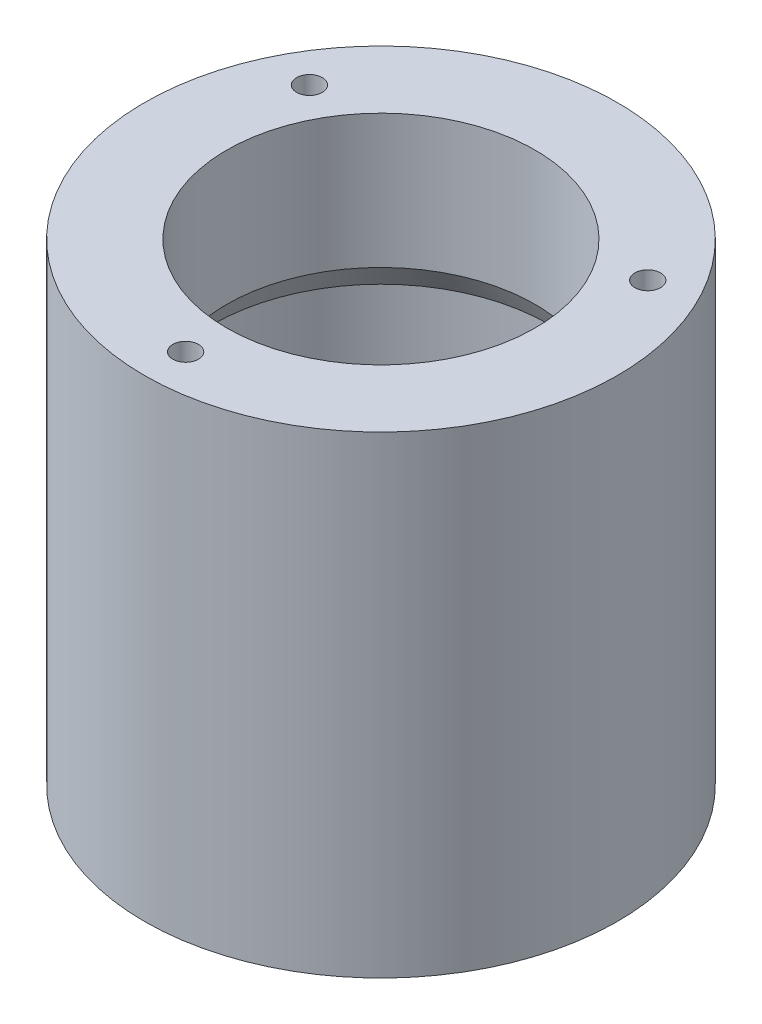
ISO-10303-21;
HEADER;
FILE_DESCRIPTION(('STEP AP214'),'2;1');
FILE_NAME('part.step','',(''),(''),'','','');
FILE_SCHEMA(('AUTOMOTIVE_DESIGN { 1 0 10303 214 1 1 1 1 }'));
ENDSEC;
DATA;
#1=APPLICATION_CONTEXT('core data for automotive mechanical design processes');
#2=APPLICATION_PROTOCOL_DEFINITION('international standard','automotive_design',2000,#1);
#3=PRODUCT_CONTEXT('',#1,'mechanical');
#4=PRODUCT('Part','Part','',(#3));
#5=PRODUCT_RELATED_PRODUCT_CATEGORY('part','',(#4));
#6=PRODUCT_DEFINITION_FORMATION('','',#4);
#7=PRODUCT_DEFINITION_CONTEXT('part definition',#1,'design');
#8=PRODUCT_DEFINITION('design','',#6,#7);
#9=PRODUCT_DEFINITION_SHAPE('','',#8);
#10=(LENGTH_UNIT() NAMED_UNIT(*) SI_UNIT(.MILLI.,.METRE.));
#11=(NAMED_UNIT(*) PLANE_ANGLE_UNIT() SI_UNIT($,.RADIAN.));
#12=(NAMED_UNIT(*) SI_UNIT($,.STERADIAN.) SOLID_ANGLE_UNIT());
#13=UNCERTAINTY_MEASURE_WITH_UNIT(LENGTH_MEASURE(1.E-05),#10,'distance_accuracy_value','');
#14=(GEOMETRIC_REPRESENTATION_CONTEXT(3) GLOBAL_UNCERTAINTY_ASSIGNED_CONTEXT((#13)) GLOBAL_UNIT_ASSIGNED_CONTEXT((#10,
#11,#12)) REPRESENTATION_CONTEXT('',''));
#15=CARTESIAN_POINT('',(0.,0.,0.));
#16=DIRECTION('',(0.,0.,1.));
#17=DIRECTION('',(1.,0.,0.));
#18=AXIS2_PLACEMENT_3D('',#15,#16,#17);
#19=CARTESIAN_POINT('',(0.,0.,0.));
#20=DIRECTION('',(0.,1.,0.));
#21=DIRECTION('',(0.,0.,1.));
#22=AXIS2_PLACEMENT_3D('',#19,#20,#21);
#23=PLANE('',#22);
#24=CARTESIAN_POINT('',(-16.4544826719044,0.,-9.49999999999985));
#25=DIRECTION('',(0.,-1.,0.));
#26=DIRECTION('',(0.,0.,-1.));
#27=AXIS2_PLACEMENT_3D('',#24,#25,#26);
#28=CIRCLE('',#27,2.1);
#29=CARTESIAN_POINT('',(-16.4544826719044,0.,-11.5999999999998));
#30=VERTEX_POINT('',#29);
#31=EDGE_CURVE('E91',#30,#30,#28,.T.);
#32=ORIENTED_EDGE('',*,*,#31,.F.);
#33=EDGE_LOOP('',(#32));
#34=FACE_BOUND('',#33,.T.);
#35=CARTESIAN_POINT('',(16.4544826719043,0.,-9.50000000000008));
#36=DIRECTION('',(0.,-1.,0.));
#37=DIRECTION('',(0.,0.,-1.));
#38=AXIS2_PLACEMENT_3D('',#35,#36,#37);
#39=CIRCLE('',#38,2.1);
#40=CARTESIAN_POINT('',(16.4544826719043,0.,-11.6000000000001));
#41=VERTEX_POINT('',#40);
#42=EDGE_CURVE('E97',#41,#41,#39,.T.);
#43=ORIENTED_EDGE('',*,*,#42,.F.);
#44=EDGE_LOOP('',(#43));
#45=FACE_BOUND('',#44,.T.);
#46=CARTESIAN_POINT('',(0.,0.,19.));
#47=DIRECTION('',(0.,-1.,0.));
#48=DIRECTION('',(0.,0.,-1.));
#49=AXIS2_PLACEMENT_3D('',#46,#47,#48);
#50=CIRCLE('',#49,2.1);
#51=CARTESIAN_POINT('',(0.,0.,16.9));
#52=VERTEX_POINT('',#51);
#53=EDGE_CURVE('E103',#52,#52,#50,.T.);
#54=ORIENTED_EDGE('',*,*,#53,.F.);
#55=EDGE_LOOP('',(#54));
#56=FACE_BOUND('',#55,.T.);
#57=CARTESIAN_POINT('',(0.,0.,0.));
#58=DIRECTION('',(0.,-1.,0.));
#59=DIRECTION('',(0.,0.,-1.));
#60=AXIS2_PLACEMENT_3D('',#57,#58,#59);
#61=CIRCLE('',#60,12.5);
#62=CARTESIAN_POINT('',(0.,0.,-12.5));
#63=VERTEX_POINT('',#62);
#64=EDGE_CURVE('E109',#63,#63,#61,.T.);
#65=ORIENTED_EDGE('',*,*,#64,.F.);
#66=EDGE_LOOP('',(#65));
#67=FACE_BOUND('',#66,.T.);
#68=CARTESIAN_POINT('',(0.,0.,0.));
#69=DIRECTION('',(0.,1.,0.));
#70=DIRECTION('',(0.,0.,1.));
#71=AXIS2_PLACEMENT_3D('',#68,#69,#70);
#72=CIRCLE('',#71,23.);
#73=CARTESIAN_POINT('',(0.,0.,23.));
#74=VERTEX_POINT('',#73);
#75=EDGE_CURVE('E11',#74,#74,#72,.T.);
#76=ORIENTED_EDGE('',*,*,#75,.F.);
#77=EDGE_LOOP('',(#76));
#78=FACE_BOUND('',#77,.T.);
#79=ADVANCED_FACE('F37',(#34,#45,#56,#67,#78),#23,.F.);
#80=CARTESIAN_POINT('',(0.,6.,0.));
#81=DIRECTION('',(0.,1.,0.));
#82=DIRECTION('',(0.,0.,1.));
#83=AXIS2_PLACEMENT_3D('',#80,#81,#82);
#84=CYLINDRICAL_SURFACE('',#83,23.);
#85=CARTESIAN_POINT('',(0.,46.,0.));
#86=DIRECTION('',(0.,1.,0.));
#87=DIRECTION('',(0.,0.,1.));
#88=AXIS2_PLACEMENT_3D('',#85,#86,#87);
#89=CIRCLE('',#88,23.);
#90=CARTESIAN_POINT('',(0.,46.,23.));
#91=VERTEX_POINT('',#90);
#92=EDGE_CURVE('E45',#91,#91,#89,.T.);
#93=ORIENTED_EDGE('',*,*,#92,.F.);
#94=EDGE_LOOP('',(#93));
#95=FACE_BOUND('',#94,.T.);
#96=ORIENTED_EDGE('',*,*,#75,.T.);
#97=EDGE_LOOP('',(#96));
#98=FACE_BOUND('',#97,.T.);
#99=ADVANCED_FACE('F135',(#95,#98),#84,.T.);
#100=CARTESIAN_POINT('',(23.,46.,0.));
#101=DIRECTION('',(0.,-1.,0.));
#102=DIRECTION('',(0.,0.,-1.));
#103=AXIS2_PLACEMENT_3D('',#100,#101,#102);
#104=PLANE('',#103);
#105=CARTESIAN_POINT('',(-16.4544826719044,46.,-9.49999999999985));
#106=DIRECTION('',(0.,1.,0.));
#107=DIRECTION('',(0.,0.,1.));
#108=AXIS2_PLACEMENT_3D('',#105,#106,#107);
#109=CIRCLE('',#108,1.24999999999999);
#110=CARTESIAN_POINT('',(-16.4544826719044,46.,-8.24999999999986));
#111=VERTEX_POINT('',#110);
#112=EDGE_CURVE('E75',#111,#111,#109,.T.);
#113=ORIENTED_EDGE('',*,*,#112,.F.);
#114=EDGE_LOOP('',(#113));
#115=FACE_BOUND('',#114,.T.);
#116=CARTESIAN_POINT('',(16.4544826719043,46.,-9.50000000000008));
#117=DIRECTION('',(0.,1.,0.));
#118=DIRECTION('',(0.,0.,1.));
#119=AXIS2_PLACEMENT_3D('',#116,#117,#118);
#120=CIRCLE('',#119,1.24999999999999);
#121=CARTESIAN_POINT('',(16.4544826719043,46.,-8.25000000000009));
#122=VERTEX_POINT('',#121);
#123=EDGE_CURVE('E74',#122,#122,#120,.T.);
#124=ORIENTED_EDGE('',*,*,#123,.F.);
#125=EDGE_LOOP('',(#124));
#126=FACE_BOUND('',#125,.T.);
#127=CARTESIAN_POINT('',(0.,46.,19.));
#128=DIRECTION('',(0.,1.,0.));
#129=DIRECTION('',(0.,0.,1.));
#130=AXIS2_PLACEMENT_3D('',#127,#128,#129);
#131=CIRCLE('',#130,1.24999999999999);
#132=CARTESIAN_POINT('',(0.,46.,20.25));
#133=VERTEX_POINT('',#132);
#134=EDGE_CURVE('E85',#133,#133,#131,.T.);
#135=ORIENTED_EDGE('',*,*,#134,.F.);
#136=EDGE_LOOP('',(#135));
#137=FACE_BOUND('',#136,.T.);
#138=CARTESIAN_POINT('',(0.,46.,0.));
#139=DIRECTION('',(0.,1.,0.));
#140=DIRECTION('',(0.,0.,1.));
#141=AXIS2_PLACEMENT_3D('',#138,#139,#140);
#142=CIRCLE('',#141,15.);
#143=CARTESIAN_POINT('',(0.,46.,15.));
#144=VERTEX_POINT('',#143);
#145=EDGE_CURVE('E127',#144,#144,#142,.T.);
#146=ORIENTED_EDGE('',*,*,#145,.F.);
#147=EDGE_LOOP('',(#146));
#148=FACE_BOUND('',#147,.T.);
#149=ORIENTED_EDGE('',*,*,#92,.T.);
#150=EDGE_LOOP('',(#149));
#151=FACE_BOUND('',#150,.T.);
#152=ADVANCED_FACE('F133',(#115,#126,#137,#148,#151),#104,.F.);
#153=CARTESIAN_POINT('',(0.,6.,0.));
#154=DIRECTION('',(0.,1.,0.));
#155=DIRECTION('',(0.,0.,1.));
#156=AXIS2_PLACEMENT_3D('',#153,#154,#155);
#157=CYLINDRICAL_SURFACE('',#156,15.);
#158=CARTESIAN_POINT('',(0.,33.,0.));
#159=DIRECTION('',(0.,1.,0.));
#160=DIRECTION('',(0.,0.,1.));
#161=AXIS2_PLACEMENT_3D('',#158,#159,#160);
#162=CIRCLE('',#161,15.);
#163=CARTESIAN_POINT('',(0.,33.,15.));
#164=VERTEX_POINT('',#163);
#165=EDGE_CURVE('E124',#164,#164,#162,.T.);
#166=ORIENTED_EDGE('',*,*,#165,.F.);
#167=EDGE_LOOP('',(#166));
#168=FACE_BOUND('',#167,.T.);
#169=ORIENTED_EDGE('',*,*,#145,.T.);
#170=EDGE_LOOP('',(#169));
#171=FACE_BOUND('',#170,.T.);
#172=ADVANCED_FACE('F187',(#168,#171),#157,.F.);
#173=CARTESIAN_POINT('',(0.,33.,0.));
#174=DIRECTION('',(0.,-1.,0.));
#175=DIRECTION('',(0.,0.,-1.));
#176=AXIS2_PLACEMENT_3D('',#173,#174,#175);
#177=CONICAL_SURFACE('',#176,15.,0.523598775598296);
#178=CARTESIAN_POINT('',(0.,30.614824582188,0.));
#179=DIRECTION('',(0.,1.,0.));
#180=DIRECTION('',(0.,0.,1.));
#181=AXIS2_PLACEMENT_3D('',#178,#179,#180);
#182=CIRCLE('',#181,16.3770816695382);
#183=CARTESIAN_POINT('',(0.,30.614824582188,16.3770816695382));
#184=VERTEX_POINT('',#183);
#185=EDGE_CURVE('E121',#184,#184,#182,.T.);
#186=ORIENTED_EDGE('',*,*,#185,.F.);
#187=EDGE_LOOP('',(#186));
#188=FACE_BOUND('',#187,.T.);
#189=ORIENTED_EDGE('',*,*,#165,.T.);
#190=EDGE_LOOP('',(#189));
#191=FACE_BOUND('',#190,.T.);
#192=ADVANCED_FACE('F181',(#188,#191),#177,.F.);
#193=CARTESIAN_POINT('',(0.,6.,0.));
#194=DIRECTION('',(0.,1.,0.));
#195=DIRECTION('',(0.,0.,1.));
#196=AXIS2_PLACEMENT_3D('',#193,#194,#195);
#197=CYLINDRICAL_SURFACE('',#196,16.3770816695382);
#198=CARTESIAN_POINT('',(0.,18.385175417812,0.));
#199=DIRECTION('',(0.,1.,0.));
#200=DIRECTION('',(0.,0.,1.));
#201=AXIS2_PLACEMENT_3D('',#198,#199,#200);
#202=CIRCLE('',#201,16.3770816695382);
#203=CARTESIAN_POINT('',(0.,18.385175417812,16.3770816695382));
#204=VERTEX_POINT('',#203);
#205=EDGE_CURVE('E118',#204,#204,#202,.T.);
#206=ORIENTED_EDGE('',*,*,#205,.F.);
#207=EDGE_LOOP('',(#206));
#208=FACE_BOUND('',#207,.T.);
#209=ORIENTED_EDGE('',*,*,#185,.T.);
#210=EDGE_LOOP('',(#209));
#211=FACE_BOUND('',#210,.T.);
#212=ADVANCED_FACE('F175',(#208,#211),#197,.F.);
#213=CARTESIAN_POINT('',(0.,18.385175417812,0.));
#214=DIRECTION('',(0.,1.,0.));
#215=DIRECTION('',(0.,0.,1.));
#216=AXIS2_PLACEMENT_3D('',#213,#214,#215);
#217=CONICAL_SURFACE('',#216,16.3770816695382,0.523598775598296);
#218=CARTESIAN_POINT('',(0.,16.,0.));
#219=DIRECTION('',(0.,1.,0.));
#220=DIRECTION('',(0.,0.,1.));
#221=AXIS2_PLACEMENT_3D('',#218,#219,#220);
#222=CIRCLE('',#221,15.);
#223=CARTESIAN_POINT('',(0.,16.,15.));
#224=VERTEX_POINT('',#223);
#225=EDGE_CURVE('E115',#224,#224,#222,.T.);
#226=ORIENTED_EDGE('',*,*,#225,.F.);
#227=EDGE_LOOP('',(#226));
#228=FACE_BOUND('',#227,.T.);
#229=ORIENTED_EDGE('',*,*,#205,.T.);
#230=EDGE_LOOP('',(#229));
#231=FACE_BOUND('',#230,.T.);
#232=ADVANCED_FACE('F169',(#228,#231),#217,.F.);
#233=CARTESIAN_POINT('',(0.,6.,0.));
#234=DIRECTION('',(0.,1.,0.));
#235=DIRECTION('',(0.,0.,1.));
#236=AXIS2_PLACEMENT_3D('',#233,#234,#235);
#237=CYLINDRICAL_SURFACE('',#236,15.);
#238=CARTESIAN_POINT('',(0.,6.,0.));
#239=DIRECTION('',(0.,1.,0.));
#240=DIRECTION('',(0.,0.,1.));
#241=AXIS2_PLACEMENT_3D('',#238,#239,#240);
#242=CIRCLE('',#241,15.);
#243=CARTESIAN_POINT('',(0.,6.,15.));
#244=VERTEX_POINT('',#243);
#245=EDGE_CURVE('E112',#244,#244,#242,.T.);
#246=ORIENTED_EDGE('',*,*,#245,.F.);
#247=EDGE_LOOP('',(#246));
#248=FACE_BOUND('',#247,.T.);
#249=ORIENTED_EDGE('',*,*,#225,.T.);
#250=EDGE_LOOP('',(#249));
#251=FACE_BOUND('',#250,.T.);
#252=ADVANCED_FACE('F163',(#248,#251),#237,.F.);
#253=CARTESIAN_POINT('',(15.,6.,0.));
#254=DIRECTION('',(0.,-1.,0.));
#255=DIRECTION('',(0.,0.,-1.));
#256=AXIS2_PLACEMENT_3D('',#253,#254,#255);
#257=PLANE('',#256);
#258=CARTESIAN_POINT('',(0.,6.,0.));
#259=DIRECTION('',(0.,-1.,0.));
#260=DIRECTION('',(0.,0.,-1.));
#261=AXIS2_PLACEMENT_3D('',#258,#259,#260);
#262=CIRCLE('',#261,12.5);
#263=CARTESIAN_POINT('',(0.,6.,-12.5));
#264=VERTEX_POINT('',#263);
#265=EDGE_CURVE('E40',#264,#264,#262,.T.);
#266=ORIENTED_EDGE('',*,*,#265,.T.);
#267=EDGE_LOOP('',(#266));
#268=FACE_BOUND('',#267,.T.);
#269=ORIENTED_EDGE('',*,*,#245,.T.);
#270=EDGE_LOOP('',(#269));
#271=FACE_BOUND('',#270,.T.);
#272=ADVANCED_FACE('F156',(#268,#271),#257,.F.);
#273=CARTESIAN_POINT('',(0.,46.,0.));
#274=DIRECTION('',(0.,-1.,0.));
#275=DIRECTION('',(0.,0.,-1.));
#276=AXIS2_PLACEMENT_3D('',#273,#274,#275);
#277=CYLINDRICAL_SURFACE('',#276,12.5);
#278=ORIENTED_EDGE('',*,*,#64,.T.);
#279=EDGE_LOOP('',(#278));
#280=FACE_BOUND('',#279,.T.);
#281=ORIENTED_EDGE('',*,*,#265,.F.);
#282=EDGE_LOOP('',(#281));
#283=FACE_BOUND('',#282,.T.);
#284=ADVANCED_FACE('F152',(#280,#283),#277,.F.);
#285=CARTESIAN_POINT('',(0.,12.,19.));
#286=DIRECTION('',(0.,-1.,0.));
#287=DIRECTION('',(0.,0.,-1.));
#288=AXIS2_PLACEMENT_3D('',#285,#286,#287);
#289=CONICAL_SURFACE('',#288,2.1,1.02974425867665);
#290=CARTESIAN_POINT('',(0.,13.2618072999579,19.));
#291=VERTEX_POINT('',#290);
#292=VERTEX_LOOP('',#291);
#293=FACE_BOUND('',#292,.T.);
#294=CARTESIAN_POINT('',(0.,12.,19.));
#295=DIRECTION('',(0.,-1.,0.));
#296=DIRECTION('',(0.,0.,-1.));
#297=AXIS2_PLACEMENT_3D('',#294,#295,#296);
#298=CIRCLE('',#297,2.1);
#299=CARTESIAN_POINT('',(0.,12.,16.9));
#300=VERTEX_POINT('',#299);
#301=EDGE_CURVE('E106',#300,#300,#298,.T.);
#302=ORIENTED_EDGE('',*,*,#301,.T.);
#303=EDGE_LOOP('',(#302));
#304=FACE_BOUND('',#303,.T.);
#305=ADVANCED_FACE('F155',(#293,#304),#289,.F.);
#306=CARTESIAN_POINT('',(0.,0.,19.));
#307=DIRECTION('',(0.,-1.,0.));
#308=DIRECTION('',(0.,0.,-1.));
#309=AXIS2_PLACEMENT_3D('',#306,#307,#308);
#310=CYLINDRICAL_SURFACE('',#309,2.1);
#311=ORIENTED_EDGE('',*,*,#301,.F.);
#312=EDGE_LOOP('',(#311));
#313=FACE_BOUND('',#312,.T.);
#314=ORIENTED_EDGE('',*,*,#53,.T.);
#315=EDGE_LOOP('',(#314));
#316=FACE_BOUND('',#315,.T.);
#317=ADVANCED_FACE('F206',(#313,#316),#310,.F.);
#318=CARTESIAN_POINT('',(16.4544826719043,12.,-9.50000000000008));
#319=DIRECTION('',(0.,-1.,0.));
#320=DIRECTION('',(0.,0.,-1.));
#321=AXIS2_PLACEMENT_3D('',#318,#319,#320);
#322=CONICAL_SURFACE('',#321,2.1,1.02974425867665);
#323=CARTESIAN_POINT('',(16.4544826719043,13.2618072999579,-9.50000000000008));
#324=VERTEX_POINT('',#323);
#325=VERTEX_LOOP('',#324);
#326=FACE_BOUND('',#325,.T.);
#327=CARTESIAN_POINT('',(16.4544826719043,12.,-9.50000000000008));
#328=DIRECTION('',(0.,-1.,0.));
#329=DIRECTION('',(0.,0.,-1.));
#330=AXIS2_PLACEMENT_3D('',#327,#328,#329);
#331=CIRCLE('',#330,2.1);
#332=CARTESIAN_POINT('',(16.4544826719043,12.,-11.6000000000001));
#333=VERTEX_POINT('',#332);
#334=EDGE_CURVE('E100',#333,#333,#331,.T.);
#335=ORIENTED_EDGE('',*,*,#334,.T.);
#336=EDGE_LOOP('',(#335));
#337=FACE_BOUND('',#336,.T.);
#338=ADVANCED_FACE('F209',(#326,#337),#322,.F.);
#339=CARTESIAN_POINT('',(16.4544826719043,0.,-9.50000000000008));
#340=DIRECTION('',(0.,-1.,0.));
#341=DIRECTION('',(0.,0.,-1.));
#342=AXIS2_PLACEMENT_3D('',#339,#340,#341);
#343=CYLINDRICAL_SURFACE('',#342,2.1);
#344=ORIENTED_EDGE('',*,*,#334,.F.);
#345=EDGE_LOOP('',(#344));
#346=FACE_BOUND('',#345,.T.);
#347=ORIENTED_EDGE('',*,*,#42,.T.);
#348=EDGE_LOOP('',(#347));
#349=FACE_BOUND('',#348,.T.);
#350=ADVANCED_FACE('F213',(#346,#349),#343,.F.);
#351=CARTESIAN_POINT('',(-16.4544826719044,12.,-9.49999999999985));
#352=DIRECTION('',(0.,-1.,0.));
#353=DIRECTION('',(0.,0.,-1.));
#354=AXIS2_PLACEMENT_3D('',#351,#352,#353);
#355=CONICAL_SURFACE('',#354,2.1,1.02974425867665);
#356=CARTESIAN_POINT('',(-16.4544826719044,13.2618072999579,-9.49999999999985));
#357=VERTEX_POINT('',#356);
#358=VERTEX_LOOP('',#357);
#359=FACE_BOUND('',#358,.T.);
#360=CARTESIAN_POINT('',(-16.4544826719044,12.,-9.49999999999985));
#361=DIRECTION('',(0.,-1.,0.));
#362=DIRECTION('',(0.,0.,-1.));
#363=AXIS2_PLACEMENT_3D('',#360,#361,#362);
#364=CIRCLE('',#363,2.1);
#365=CARTESIAN_POINT('',(-16.4544826719044,12.,-11.5999999999998));
#366=VERTEX_POINT('',#365);
#367=EDGE_CURVE('E94',#366,#366,#364,.T.);
#368=ORIENTED_EDGE('',*,*,#367,.T.);
#369=EDGE_LOOP('',(#368));
#370=FACE_BOUND('',#369,.T.);
#371=ADVANCED_FACE('F216',(#359,#370),#355,.F.);
#372=CARTESIAN_POINT('',(-16.4544826719044,0.,-9.49999999999985));
#373=DIRECTION('',(0.,-1.,0.));
#374=DIRECTION('',(0.,0.,-1.));
#375=AXIS2_PLACEMENT_3D('',#372,#373,#374);
#376=CYLINDRICAL_SURFACE('',#375,2.1);
#377=ORIENTED_EDGE('',*,*,#367,.F.);
#378=EDGE_LOOP('',(#377));
#379=FACE_BOUND('',#378,.T.);
#380=ORIENTED_EDGE('',*,*,#31,.T.);
#381=EDGE_LOOP('',(#380));
#382=FACE_BOUND('',#381,.T.);
#383=ADVANCED_FACE('F220',(#379,#382),#376,.F.);
#384=CARTESIAN_POINT('',(0.,37.5,19.));
#385=DIRECTION('',(0.,1.,0.));
#386=DIRECTION('',(0.,0.,1.));
#387=AXIS2_PLACEMENT_3D('',#384,#385,#386);
#388=CONICAL_SURFACE('',#387,1.25,1.02974425867665);
#389=CARTESIAN_POINT('',(0.,36.7489242262155,19.));
#390=VERTEX_POINT('',#389);
#391=VERTEX_LOOP('',#390);
#392=FACE_BOUND('',#391,.T.);
#393=CARTESIAN_POINT('',(0.,37.5,19.));
#394=DIRECTION('',(0.,1.,0.));
#395=DIRECTION('',(0.,0.,1.));
#396=AXIS2_PLACEMENT_3D('',#393,#394,#395);
#397=CIRCLE('',#396,1.25);
#398=CARTESIAN_POINT('',(0.,37.5,20.25));
#399=VERTEX_POINT('',#398);
#400=EDGE_CURVE('E88',#399,#399,#397,.T.);
#401=ORIENTED_EDGE('',*,*,#400,.T.);
#402=EDGE_LOOP('',(#401));
#403=FACE_BOUND('',#402,.T.);
#404=ADVANCED_FACE('F224',(#392,#403),#388,.F.);
#405=CARTESIAN_POINT('',(0.,46.,19.));
#406=DIRECTION('',(0.,1.,0.));
#407=DIRECTION('',(0.,0.,1.));
#408=AXIS2_PLACEMENT_3D('',#405,#406,#407);
#409=CYLINDRICAL_SURFACE('',#408,1.24999999999999);
#410=ORIENTED_EDGE('',*,*,#400,.F.);
#411=EDGE_LOOP('',(#410));
#412=FACE_BOUND('',#411,.T.);
#413=ORIENTED_EDGE('',*,*,#134,.T.);
#414=EDGE_LOOP('',(#413));
#415=FACE_BOUND('',#414,.T.);
#416=ADVANCED_FACE('F228',(#412,#415),#409,.F.);
#417=CARTESIAN_POINT('',(16.4544826719043,37.5,-9.50000000000008));
#418=DIRECTION('',(0.,1.,0.));
#419=DIRECTION('',(0.,0.,1.));
#420=AXIS2_PLACEMENT_3D('',#417,#418,#419);
#421=CONICAL_SURFACE('',#420,1.25,1.02974425867665);
#422=CARTESIAN_POINT('',(16.4544826719043,36.7489242262155,-9.50000000000008));
#423=VERTEX_POINT('',#422);
#424=VERTEX_LOOP('',#423);
#425=FACE_BOUND('',#424,.T.);
#426=CARTESIAN_POINT('',(16.4544826719043,37.5,-9.50000000000008));
#427=DIRECTION('',(0.,1.,0.));
#428=DIRECTION('',(0.,0.,1.));
#429=AXIS2_PLACEMENT_3D('',#426,#427,#428);
#430=CIRCLE('',#429,1.25);
#431=CARTESIAN_POINT('',(16.4544826719043,37.5,-8.25000000000008));
#432=VERTEX_POINT('',#431);
#433=EDGE_CURVE('E78',#432,#432,#430,.T.);
#434=ORIENTED_EDGE('',*,*,#433,.T.);
#435=EDGE_LOOP('',(#434));
#436=FACE_BOUND('',#435,.T.);
#437=ADVANCED_FACE('F232',(#425,#436),#421,.F.);
#438=CARTESIAN_POINT('',(16.4544826719043,46.,-9.50000000000008));
#439=DIRECTION('',(0.,1.,0.));
#440=DIRECTION('',(0.,0.,1.));
#441=AXIS2_PLACEMENT_3D('',#438,#439,#440);
#442=CYLINDRICAL_SURFACE('',#441,1.24999999999999);
#443=ORIENTED_EDGE('',*,*,#433,.F.);
#444=EDGE_LOOP('',(#443));
#445=FACE_BOUND('',#444,.T.);
#446=ORIENTED_EDGE('',*,*,#123,.T.);
#447=EDGE_LOOP('',(#446));
#448=FACE_BOUND('',#447,.T.);
#449=ADVANCED_FACE('F68',(#445,#448),#442,.F.);
#450=CARTESIAN_POINT('',(-16.4544826719044,37.5,-9.49999999999985));
#451=DIRECTION('',(0.,1.,0.));
#452=DIRECTION('',(0.,0.,1.));
#453=AXIS2_PLACEMENT_3D('',#450,#451,#452);
#454=CONICAL_SURFACE('',#453,1.25,1.02974425867665);
#455=CARTESIAN_POINT('',(-16.4544826719044,36.7489242262155,-9.49999999999985));
#456=VERTEX_POINT('',#455);
#457=VERTEX_LOOP('',#456);
#458=FACE_BOUND('',#457,.T.);
#459=CARTESIAN_POINT('',(-16.4544826719044,37.5,-9.49999999999985));
#460=DIRECTION('',(0.,1.,0.));
#461=DIRECTION('',(0.,0.,1.));
#462=AXIS2_PLACEMENT_3D('',#459,#460,#461);
#463=CIRCLE('',#462,1.25);
#464=CARTESIAN_POINT('',(-16.4544826719044,37.5,-8.24999999999985));
#465=VERTEX_POINT('',#464);
#466=EDGE_CURVE('E72',#465,#465,#463,.T.);
#467=ORIENTED_EDGE('',*,*,#466,.T.);
#468=EDGE_LOOP('',(#467));
#469=FACE_BOUND('',#468,.T.);
#470=ADVANCED_FACE('F64',(#458,#469),#454,.F.);
#471=CARTESIAN_POINT('',(-16.4544826719044,46.,-9.49999999999985));
#472=DIRECTION('',(0.,1.,0.));
#473=DIRECTION('',(0.,0.,1.));
#474=AXIS2_PLACEMENT_3D('',#471,#472,#473);
#475=CYLINDRICAL_SURFACE('',#474,1.24999999999999);
#476=ORIENTED_EDGE('',*,*,#466,.F.);
#477=EDGE_LOOP('',(#476));
#478=FACE_BOUND('',#477,.T.);
#479=ORIENTED_EDGE('',*,*,#112,.T.);
#480=EDGE_LOOP('',(#479));
#481=FACE_BOUND('',#480,.T.);
#482=ADVANCED_FACE('F67',(#478,#481),#475,.F.);
#483=CLOSED_SHELL('',(#79,#99,#152,#172,#192,#212,#232,#252,#272,#284,#305,#317,#338,#350,#371,
#383,#404,#416,#437,#449,#470,#482));
#484=MANIFOLD_SOLID_BREP('B2',#483);
#485=ADVANCED_BREP_SHAPE_REPRESENTATION('',(#18,#484),#14);
#486=SHAPE_DEFINITION_REPRESENTATION(#9,#485);
ENDSEC;
END-ISO-10303-21;
